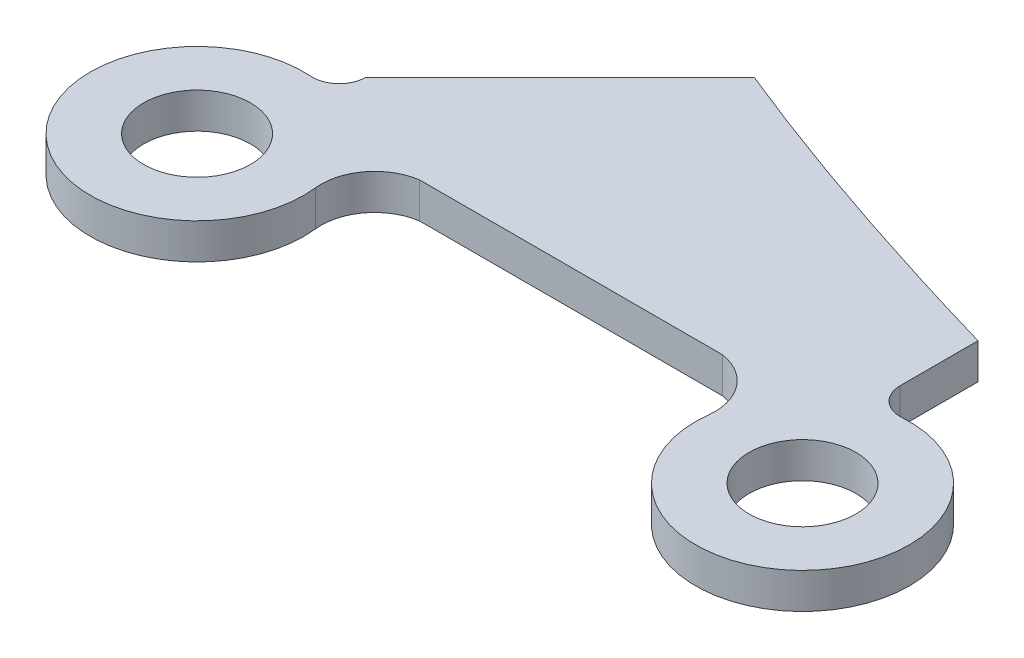
ISO-10303-21;
HEADER;
FILE_DESCRIPTION(('STEP AP214'),'2;1');
FILE_NAME('part.step','',(''),(''),'','','');
FILE_SCHEMA(('AUTOMOTIVE_DESIGN { 1 0 10303 214 1 1 1 1 }'));
ENDSEC;
DATA;
#1=APPLICATION_CONTEXT('core data for automotive mechanical design processes');
#2=APPLICATION_PROTOCOL_DEFINITION('international standard','automotive_design',2000,#1);
#3=PRODUCT_CONTEXT('',#1,'mechanical');
#4=PRODUCT('Part','Part','',(#3));
#5=PRODUCT_RELATED_PRODUCT_CATEGORY('part','',(#4));
#6=PRODUCT_DEFINITION_FORMATION('','',#4);
#7=PRODUCT_DEFINITION_CONTEXT('part definition',#1,'design');
#8=PRODUCT_DEFINITION('design','',#6,#7);
#9=PRODUCT_DEFINITION_SHAPE('','',#8);
#10=(LENGTH_UNIT() NAMED_UNIT(*) SI_UNIT(.MILLI.,.METRE.));
#11=(NAMED_UNIT(*) PLANE_ANGLE_UNIT() SI_UNIT($,.RADIAN.));
#12=(NAMED_UNIT(*) SI_UNIT($,.STERADIAN.) SOLID_ANGLE_UNIT());
#13=UNCERTAINTY_MEASURE_WITH_UNIT(LENGTH_MEASURE(1.E-05),#10,'distance_accuracy_value','');
#14=(GEOMETRIC_REPRESENTATION_CONTEXT(3) GLOBAL_UNCERTAINTY_ASSIGNED_CONTEXT((#13)) GLOBAL_UNIT_ASSIGNED_CONTEXT((#10,
#11,#12)) REPRESENTATION_CONTEXT('',''));
#15=CARTESIAN_POINT('',(0.,0.,0.));
#16=DIRECTION('',(0.,0.,1.));
#17=DIRECTION('',(1.,0.,0.));
#18=AXIS2_PLACEMENT_3D('',#15,#16,#17);
#19=CARTESIAN_POINT('',(1003.5,-336.43981096134,430.79991693377));
#20=DIRECTION('',(0.,-1.,0.));
#21=DIRECTION('',(0.,0.,-1.));
#22=AXIS2_PLACEMENT_3D('',#19,#20,#21);
#23=PLANE('',#22);
#24=CARTESIAN_POINT('',(1003.,-336.43981096134,438.283231707318));
#25=DIRECTION('',(0.,-1.,0.));
#26=DIRECTION('',(0.,0.,-1.));
#27=AXIS2_PLACEMENT_3D('',#24,#25,#26);
#28=CIRCLE('',#27,2.99999999999994);
#29=CARTESIAN_POINT('',(1003.,-336.43981096134,435.283231707318));
#30=VERTEX_POINT('',#29);
#31=EDGE_CURVE('E246',#30,#30,#28,.T.);
#32=ORIENTED_EDGE('',*,*,#31,.F.);
#33=EDGE_LOOP('',(#32));
#34=FACE_BOUND('',#33,.T.);
#35=CARTESIAN_POINT('',(1003.5,-336.43981096134,430.79991693377));
#36=DIRECTION('',(0.,-1.,0.));
#37=DIRECTION('',(0.,0.,-1.));
#38=AXIS2_PLACEMENT_3D('',#35,#36,#37);
#39=CIRCLE('',#38,1.5);
#40=CARTESIAN_POINT('',(1005.,-336.43981096134,430.79991693377));
#41=VERTEX_POINT('',#40);
#42=CARTESIAN_POINT('',(1003.4,-336.43981096134,432.29657988848));
#43=VERTEX_POINT('',#42);
#44=EDGE_CURVE('E271',#41,#43,#39,.T.);
#45=ORIENTED_EDGE('',*,*,#44,.F.);
#46=DIRECTION('',(0.707106781186916,0.,-0.707106781186179));
#47=VECTOR('',#46,1.);
#48=CARTESIAN_POINT('',(1005.,-336.43981096134,430.79991693377));
#49=LINE('',#48,#47);
#50=CARTESIAN_POINT('',(1015.90379797932,-336.43981096134,419.896118954459));
#51=VERTEX_POINT('',#50);
#52=EDGE_CURVE('E215',#41,#51,#49,.T.);
#53=ORIENTED_EDGE('',*,*,#52,.T.);
#54=CARTESIAN_POINT('',(1015.90379797933,-336.43981096134,419.896118954461));
#55=CARTESIAN_POINT('',(1021.18574672281,-336.43981096134,422.066519939314));
#56=CARTESIAN_POINT('',(1027.58904483357,-336.43981096134,424.27172398807));
#57=CARTESIAN_POINT('',(1034.99999999986,-336.43981096134,426.4272406204));
#58=(BOUNDED_CURVE() B_SPLINE_CURVE(3,(#54,#55,#56,#57),.UNSPECIFIED.,.F.,
.F.) B_SPLINE_CURVE_WITH_KNOTS((4,4),(0.141934854100476,0.193423321701997),
.UNSPECIFIED.) CURVE() GEOMETRIC_REPRESENTATION_ITEM() RATIONAL_B_SPLINE_CURVE((0.593424606066283,
0.56374935932761,0.54114361204481,0.525607364217886)) REPRESENTATION_ITEM(''));
#59=CARTESIAN_POINT('',(1034.99999999986,-336.43981096134,426.4272406204));
#60=VERTEX_POINT('',#59);
#61=EDGE_CURVE('E210',#51,#60,#58,.T.);
#62=ORIENTED_EDGE('',*,*,#61,.T.);
#63=DIRECTION('',(0.,0.,1.));
#64=VECTOR('',#63,1.);
#65=CARTESIAN_POINT('',(1035.,-336.43981096134,430.712849211409));
#66=LINE('',#65,#64);
#67=CARTESIAN_POINT('',(1035.,-336.43981096134,430.79991693377));
#68=VERTEX_POINT('',#67);
#69=EDGE_CURVE('E200',#60,#68,#66,.T.);
#70=ORIENTED_EDGE('',*,*,#69,.T.);
#71=CARTESIAN_POINT('',(1036.5,-336.43981096134,430.79991693377));
#72=DIRECTION('',(0.,-1.,0.));
#73=DIRECTION('',(0.,0.,-1.));
#74=AXIS2_PLACEMENT_3D('',#71,#72,#73);
#75=CIRCLE('',#74,1.50000000000005);
#76=CARTESIAN_POINT('',(1036.6,-336.43981096134,432.29657988848));
#77=VERTEX_POINT('',#76);
#78=EDGE_CURVE('E211',#77,#68,#75,.T.);
#79=ORIENTED_EDGE('',*,*,#78,.F.);
#80=CARTESIAN_POINT('',(1037.,-336.43981096134,438.283231707318));
#81=DIRECTION('',(0.,-1.,0.));
#82=DIRECTION('',(0.,0.,-1.));
#83=AXIS2_PLACEMENT_3D('',#80,#81,#82);
#84=CIRCLE('',#83,5.99999999999999);
#85=CARTESIAN_POINT('',(1031.03961645221,-336.43981096134,437.594880079705));
#86=VERTEX_POINT('',#85);
#87=EDGE_CURVE('E286',#77,#86,#84,.T.);
#88=ORIENTED_EDGE('',*,*,#87,.T.);
#89=CARTESIAN_POINT('',(1028.05942467832,-336.43981096134,437.250704265898));
#90=DIRECTION('',(0.,-1.,0.));
#91=DIRECTION('',(0.,0.,-1.));
#92=AXIS2_PLACEMENT_3D('',#89,#90,#91);
#93=CIRCLE('',#92,2.99999999999996);
#94=CARTESIAN_POINT('',(1028.5,-336.43981096134,434.283231707318));
#95=VERTEX_POINT('',#94);
#96=EDGE_CURVE('E283',#95,#86,#93,.T.);
#97=ORIENTED_EDGE('',*,*,#96,.F.);
#98=DIRECTION('',(-1.,0.,0.));
#99=VECTOR('',#98,1.);
#100=CARTESIAN_POINT('',(1028.5,-336.43981096134,434.283231707318));
#101=LINE('',#100,#99);
#102=CARTESIAN_POINT('',(1011.5,-336.43981096134,434.283231707318));
#103=VERTEX_POINT('',#102);
#104=EDGE_CURVE('E281',#95,#103,#101,.T.);
#105=ORIENTED_EDGE('',*,*,#104,.T.);
#106=CARTESIAN_POINT('',(1011.94057532168,-336.43981096134,437.250704265898));
#107=DIRECTION('',(0.,-1.,0.));
#108=DIRECTION('',(0.,0.,-1.));
#109=AXIS2_PLACEMENT_3D('',#106,#107,#108);
#110=CIRCLE('',#109,2.99999999999996);
#111=CARTESIAN_POINT('',(1008.96038354779,-336.43981096134,437.594880079705));
#112=VERTEX_POINT('',#111);
#113=EDGE_CURVE('E273',#112,#103,#110,.T.);
#114=ORIENTED_EDGE('',*,*,#113,.F.);
#115=CARTESIAN_POINT('',(1003.,-336.43981096134,438.283231707318));
#116=DIRECTION('',(0.,-1.,0.));
#117=DIRECTION('',(0.,0.,-1.));
#118=AXIS2_PLACEMENT_3D('',#115,#116,#117);
#119=CIRCLE('',#118,6.00000000000004);
#120=EDGE_CURVE('E178',#112,#43,#119,.T.);
#121=ORIENTED_EDGE('',*,*,#120,.T.);
#122=EDGE_LOOP('',(#45,#53,#62,#70,#79,#88,#97,#105,#114,#121));
#123=FACE_BOUND('',#122,.T.);
#124=CARTESIAN_POINT('',(1037.,-336.43981096134,438.283231707318));
#125=DIRECTION('',(0.,-1.,0.));
#126=DIRECTION('',(0.,0.,-1.));
#127=AXIS2_PLACEMENT_3D('',#124,#125,#126);
#128=CIRCLE('',#127,2.99999999999994);
#129=CARTESIAN_POINT('',(1037.,-336.43981096134,435.283231707318));
#130=VERTEX_POINT('',#129);
#131=EDGE_CURVE('E357',#130,#130,#128,.T.);
#132=ORIENTED_EDGE('',*,*,#131,.F.);
#133=EDGE_LOOP('',(#132));
#134=FACE_BOUND('',#133,.T.);
#135=ADVANCED_FACE('F116',(#34,#123,#134),#23,.T.);
#136=CARTESIAN_POINT('',(1003.5,-334.43981096134,430.79991693377));
#137=DIRECTION('',(0.,-1.,0.));
#138=DIRECTION('',(0.,0.,-1.));
#139=AXIS2_PLACEMENT_3D('',#136,#137,#138);
#140=PLANE('',#139);
#141=CARTESIAN_POINT('',(1003.5,-334.43981096134,430.79991693377));
#142=DIRECTION('',(0.,-1.,0.));
#143=DIRECTION('',(0.,0.,-1.));
#144=AXIS2_PLACEMENT_3D('',#141,#142,#143);
#145=CIRCLE('',#144,1.5);
#146=CARTESIAN_POINT('',(1005.,-334.43981096134,430.79991693377));
#147=VERTEX_POINT('',#146);
#148=CARTESIAN_POINT('',(1003.4,-334.43981096134,432.29657988848));
#149=VERTEX_POINT('',#148);
#150=EDGE_CURVE('E242',#147,#149,#145,.T.);
#151=ORIENTED_EDGE('',*,*,#150,.T.);
#152=CARTESIAN_POINT('',(1003.,-334.43981096134,438.283231707318));
#153=DIRECTION('',(0.,-1.,0.));
#154=DIRECTION('',(0.,0.,-1.));
#155=AXIS2_PLACEMENT_3D('',#152,#153,#154);
#156=CIRCLE('',#155,6.00000000000004);
#157=CARTESIAN_POINT('',(1008.96038354779,-334.43981096134,437.594880079705));
#158=VERTEX_POINT('',#157);
#159=EDGE_CURVE('E245',#158,#149,#156,.T.);
#160=ORIENTED_EDGE('',*,*,#159,.F.);
#161=CARTESIAN_POINT('',(1011.94057532168,-334.43981096134,437.250704265898));
#162=DIRECTION('',(0.,-1.,0.));
#163=DIRECTION('',(0.,0.,-1.));
#164=AXIS2_PLACEMENT_3D('',#161,#162,#163);
#165=CIRCLE('',#164,2.99999999999996);
#166=CARTESIAN_POINT('',(1011.5,-334.43981096134,434.283231707318));
#167=VERTEX_POINT('',#166);
#168=EDGE_CURVE('E248',#158,#167,#165,.T.);
#169=ORIENTED_EDGE('',*,*,#168,.T.);
#170=DIRECTION('',(-1.,0.,0.));
#171=VECTOR('',#170,1.);
#172=CARTESIAN_POINT('',(1028.5,-334.43981096134,434.283231707318));
#173=LINE('',#172,#171);
#174=CARTESIAN_POINT('',(1028.5,-334.43981096134,434.283231707318));
#175=VERTEX_POINT('',#174);
#176=EDGE_CURVE('E251',#175,#167,#173,.T.);
#177=ORIENTED_EDGE('',*,*,#176,.F.);
#178=CARTESIAN_POINT('',(1028.05942467832,-334.43981096134,437.250704265898));
#179=DIRECTION('',(0.,-1.,0.));
#180=DIRECTION('',(0.,0.,-1.));
#181=AXIS2_PLACEMENT_3D('',#178,#179,#180);
#182=CIRCLE('',#181,2.99999999999996);
#183=CARTESIAN_POINT('',(1031.03961645221,-334.43981096134,437.594880079705));
#184=VERTEX_POINT('',#183);
#185=EDGE_CURVE('E254',#175,#184,#182,.T.);
#186=ORIENTED_EDGE('',*,*,#185,.T.);
#187=CARTESIAN_POINT('',(1037.,-334.43981096134,438.283231707318));
#188=DIRECTION('',(0.,-1.,0.));
#189=DIRECTION('',(0.,0.,-1.));
#190=AXIS2_PLACEMENT_3D('',#187,#188,#189);
#191=CIRCLE('',#190,5.99999999999999);
#192=CARTESIAN_POINT('',(1036.6,-334.43981096134,432.29657988848));
#193=VERTEX_POINT('',#192);
#194=EDGE_CURVE('E257',#193,#184,#191,.T.);
#195=ORIENTED_EDGE('',*,*,#194,.F.);
#196=CARTESIAN_POINT('',(1036.5,-334.43981096134,430.79991693377));
#197=DIRECTION('',(0.,-1.,0.));
#198=DIRECTION('',(0.,0.,-1.));
#199=AXIS2_PLACEMENT_3D('',#196,#197,#198);
#200=CIRCLE('',#199,1.50000000000005);
#201=CARTESIAN_POINT('',(1035.,-334.43981096134,430.79991693377));
#202=VERTEX_POINT('',#201);
#203=EDGE_CURVE('E260',#193,#202,#200,.T.);
#204=ORIENTED_EDGE('',*,*,#203,.T.);
#205=DIRECTION('',(0.,0.,-1.));
#206=VECTOR('',#205,1.);
#207=CARTESIAN_POINT('',(1035.,-334.43981096134,430.712849211409));
#208=LINE('',#207,#206);
#209=CARTESIAN_POINT('',(1034.99999999986,-334.43981096134,426.4272406204));
#210=VERTEX_POINT('',#209);
#211=EDGE_CURVE('E263',#202,#210,#208,.T.);
#212=ORIENTED_EDGE('',*,*,#211,.T.);
#213=CARTESIAN_POINT('',(1015.90379797933,-334.43981096134,419.89611895446));
#214=CARTESIAN_POINT('',(1021.18574672281,-334.43981096134,422.066519939314));
#215=CARTESIAN_POINT('',(1027.58904483357,-334.43981096134,424.27172398807));
#216=CARTESIAN_POINT('',(1034.99999999986,-334.43981096134,426.4272406204));
#217=(BOUNDED_CURVE() B_SPLINE_CURVE(3,(#213,#214,#215,#216),.UNSPECIFIED.,.F.,
.F.) B_SPLINE_CURVE_WITH_KNOTS((4,4),(0.141934854100476,0.193423321701997),
.UNSPECIFIED.) CURVE() GEOMETRIC_REPRESENTATION_ITEM() RATIONAL_B_SPLINE_CURVE((0.593424606066283,
0.56374935932761,0.54114361204481,0.525607364217886)) REPRESENTATION_ITEM(''));
#218=CARTESIAN_POINT('',(1015.90379797932,-334.43981096134,419.896118954459));
#219=VERTEX_POINT('',#218);
#220=EDGE_CURVE('E220',#219,#210,#217,.T.);
#221=ORIENTED_EDGE('',*,*,#220,.F.);
#222=DIRECTION('',(0.707106781186916,0.,-0.707106781186179));
#223=VECTOR('',#222,1.);
#224=CARTESIAN_POINT('',(1005.,-334.43981096134,430.79991693377));
#225=LINE('',#224,#223);
#226=EDGE_CURVE('E168',#147,#219,#225,.T.);
#227=ORIENTED_EDGE('',*,*,#226,.F.);
#228=EDGE_LOOP('',(#151,#160,#169,#177,#186,#195,#204,#212,#221,#227));
#229=FACE_BOUND('',#228,.T.);
#230=CARTESIAN_POINT('',(1003.,-334.43981096134,438.283231707318));
#231=DIRECTION('',(0.,-1.,0.));
#232=DIRECTION('',(0.,0.,-1.));
#233=AXIS2_PLACEMENT_3D('',#230,#231,#232);
#234=CIRCLE('',#233,2.99999999999994);
#235=CARTESIAN_POINT('',(1003.,-334.43981096134,435.283231707318));
#236=VERTEX_POINT('',#235);
#237=EDGE_CURVE('E276',#236,#236,#234,.T.);
#238=ORIENTED_EDGE('',*,*,#237,.T.);
#239=EDGE_LOOP('',(#238));
#240=FACE_BOUND('',#239,.T.);
#241=CARTESIAN_POINT('',(1037.,-334.43981096134,438.283231707318));
#242=DIRECTION('',(0.,-1.,0.));
#243=DIRECTION('',(0.,0.,-1.));
#244=AXIS2_PLACEMENT_3D('',#241,#242,#243);
#245=CIRCLE('',#244,2.99999999999994);
#246=CARTESIAN_POINT('',(1037.,-334.43981096134,435.283231707318));
#247=VERTEX_POINT('',#246);
#248=EDGE_CURVE('E359',#247,#247,#245,.T.);
#249=ORIENTED_EDGE('',*,*,#248,.T.);
#250=EDGE_LOOP('',(#249));
#251=FACE_BOUND('',#250,.T.);
#252=ADVANCED_FACE('F310',(#229,#240,#251),#140,.F.);
#253=CARTESIAN_POINT('',(1003.5,-336.43981096134,430.79991693377));
#254=DIRECTION('',(0.,1.,0.));
#255=DIRECTION('',(0.,0.,1.));
#256=AXIS2_PLACEMENT_3D('',#253,#254,#255);
#257=CYLINDRICAL_SURFACE('',#256,1.5);
#258=ORIENTED_EDGE('',*,*,#150,.F.);
#259=DIRECTION('',(0.,1.,0.));
#260=VECTOR('',#259,1.);
#261=CARTESIAN_POINT('',(1005.,-336.43981096134,430.79991693377));
#262=LINE('',#261,#260);
#263=EDGE_CURVE('E12',#41,#147,#262,.T.);
#264=ORIENTED_EDGE('',*,*,#263,.F.);
#265=ORIENTED_EDGE('',*,*,#44,.T.);
#266=DIRECTION('',(0.,1.,0.));
#267=VECTOR('',#266,1.);
#268=CARTESIAN_POINT('',(1003.4,-336.43981096134,432.29657988848));
#269=LINE('',#268,#267);
#270=EDGE_CURVE('E120',#43,#149,#269,.T.);
#271=ORIENTED_EDGE('',*,*,#270,.T.);
#272=EDGE_LOOP('',(#258,#264,#265,#271));
#273=FACE_BOUND('',#272,.T.);
#274=ADVANCED_FACE('F118',(#273),#257,.F.);
#275=CARTESIAN_POINT('',(1005.,-336.43981096134,430.79991693377));
#276=DIRECTION('',(0.707106781186179,0.,0.707106781186916));
#277=DIRECTION('',(0.707106781186916,0.,-0.707106781186179));
#278=AXIS2_PLACEMENT_3D('',#275,#276,#277);
#279=PLANE('',#278);
#280=ORIENTED_EDGE('',*,*,#226,.T.);
#281=DIRECTION('',(0.,1.,0.));
#282=VECTOR('',#281,1.);
#283=CARTESIAN_POINT('',(1015.90379797932,-336.43981096134,419.896118954459));
#284=LINE('',#283,#282);
#285=EDGE_CURVE('E126',#51,#219,#284,.T.);
#286=ORIENTED_EDGE('',*,*,#285,.F.);
#287=ORIENTED_EDGE('',*,*,#52,.F.);
#288=ORIENTED_EDGE('',*,*,#263,.T.);
#289=EDGE_LOOP('',(#280,#286,#287,#288));
#290=FACE_BOUND('',#289,.T.);
#291=ADVANCED_FACE('F313',(#290),#279,.F.);
#292=DIRECTION('',(0.,1.,0.));
#293=VECTOR('',#292,1.);
#294=SURFACE_OF_LINEAR_EXTRUSION('',#58,#293);
#295=ORIENTED_EDGE('',*,*,#220,.T.);
#296=DIRECTION('',(0.,1.,0.));
#297=VECTOR('',#296,1.);
#298=CARTESIAN_POINT('',(1034.99999999986,-336.43981096134,426.4272406204));
#299=LINE('',#298,#297);
#300=EDGE_CURVE('E204',#60,#210,#299,.T.);
#301=ORIENTED_EDGE('',*,*,#300,.F.);
#302=ORIENTED_EDGE('',*,*,#61,.F.);
#303=ORIENTED_EDGE('',*,*,#285,.T.);
#304=EDGE_LOOP('',(#295,#301,#302,#303));
#305=FACE_BOUND('',#304,.T.);
#306=ADVANCED_FACE('F218',(#305),#294,.F.);
#307=CARTESIAN_POINT('',(1035.,-336.43981096134,430.712849211409));
#308=DIRECTION('',(1.,0.,0.));
#309=DIRECTION('',(0.,0.,-1.));
#310=AXIS2_PLACEMENT_3D('',#307,#308,#309);
#311=PLANE('',#310);
#312=ORIENTED_EDGE('',*,*,#211,.F.);
#313=DIRECTION('',(0.,1.,0.));
#314=VECTOR('',#313,1.);
#315=CARTESIAN_POINT('',(1035.,-336.43981096134,430.79991693377));
#316=LINE('',#315,#314);
#317=EDGE_CURVE('E207',#68,#202,#316,.T.);
#318=ORIENTED_EDGE('',*,*,#317,.F.);
#319=ORIENTED_EDGE('',*,*,#69,.F.);
#320=ORIENTED_EDGE('',*,*,#300,.T.);
#321=EDGE_LOOP('',(#312,#318,#319,#320));
#322=FACE_BOUND('',#321,.T.);
#323=ADVANCED_FACE('F202',(#322),#311,.T.);
#324=CARTESIAN_POINT('',(1036.5,-336.43981096134,430.79991693377));
#325=DIRECTION('',(0.,1.,0.));
#326=DIRECTION('',(0.,0.,1.));
#327=AXIS2_PLACEMENT_3D('',#324,#325,#326);
#328=CYLINDRICAL_SURFACE('',#327,1.50000000000005);
#329=ORIENTED_EDGE('',*,*,#203,.F.);
#330=DIRECTION('',(0.,1.,0.));
#331=VECTOR('',#330,1.);
#332=CARTESIAN_POINT('',(1036.6,-336.43981096134,432.29657988848));
#333=LINE('',#332,#331);
#334=EDGE_CURVE('E224',#77,#193,#333,.T.);
#335=ORIENTED_EDGE('',*,*,#334,.F.);
#336=ORIENTED_EDGE('',*,*,#78,.T.);
#337=ORIENTED_EDGE('',*,*,#317,.T.);
#338=EDGE_LOOP('',(#329,#335,#336,#337));
#339=FACE_BOUND('',#338,.T.);
#340=ADVANCED_FACE('F290',(#339),#328,.F.);
#341=CARTESIAN_POINT('',(1037.,-336.43981096134,438.283231707318));
#342=DIRECTION('',(0.,1.,0.));
#343=DIRECTION('',(0.,0.,1.));
#344=AXIS2_PLACEMENT_3D('',#341,#342,#343);
#345=CYLINDRICAL_SURFACE('',#344,5.99999999999999);
#346=ORIENTED_EDGE('',*,*,#194,.T.);
#347=DIRECTION('',(0.,1.,0.));
#348=VECTOR('',#347,1.);
#349=CARTESIAN_POINT('',(1031.03961645221,-336.43981096134,437.594880079705));
#350=LINE('',#349,#348);
#351=EDGE_CURVE('E228',#86,#184,#350,.T.);
#352=ORIENTED_EDGE('',*,*,#351,.F.);
#353=ORIENTED_EDGE('',*,*,#87,.F.);
#354=ORIENTED_EDGE('',*,*,#334,.T.);
#355=EDGE_LOOP('',(#346,#352,#353,#354));
#356=FACE_BOUND('',#355,.T.);
#357=ADVANCED_FACE('F295',(#356),#345,.T.);
#358=CARTESIAN_POINT('',(1028.05942467832,-336.43981096134,437.250704265898));
#359=DIRECTION('',(0.,1.,0.));
#360=DIRECTION('',(0.,0.,1.));
#361=AXIS2_PLACEMENT_3D('',#358,#359,#360);
#362=CYLINDRICAL_SURFACE('',#361,2.99999999999996);
#363=ORIENTED_EDGE('',*,*,#185,.F.);
#364=DIRECTION('',(0.,1.,0.));
#365=VECTOR('',#364,1.);
#366=CARTESIAN_POINT('',(1028.5,-336.43981096134,434.283231707318));
#367=LINE('',#366,#365);
#368=EDGE_CURVE('E230',#95,#175,#367,.T.);
#369=ORIENTED_EDGE('',*,*,#368,.F.);
#370=ORIENTED_EDGE('',*,*,#96,.T.);
#371=ORIENTED_EDGE('',*,*,#351,.T.);
#372=EDGE_LOOP('',(#363,#369,#370,#371));
#373=FACE_BOUND('',#372,.T.);
#374=ADVANCED_FACE('F299',(#373),#362,.F.);
#375=CARTESIAN_POINT('',(1028.5,-336.43981096134,434.283231707318));
#376=DIRECTION('',(0.,0.,-1.));
#377=DIRECTION('',(0.,1.,0.));
#378=AXIS2_PLACEMENT_3D('',#375,#376,#377);
#379=PLANE('',#378);
#380=ORIENTED_EDGE('',*,*,#176,.T.);
#381=DIRECTION('',(0.,1.,0.));
#382=VECTOR('',#381,1.);
#383=CARTESIAN_POINT('',(1011.5,-336.43981096134,434.283231707318));
#384=LINE('',#383,#382);
#385=EDGE_CURVE('E232',#103,#167,#384,.T.);
#386=ORIENTED_EDGE('',*,*,#385,.F.);
#387=ORIENTED_EDGE('',*,*,#104,.F.);
#388=ORIENTED_EDGE('',*,*,#368,.T.);
#389=EDGE_LOOP('',(#380,#386,#387,#388));
#390=FACE_BOUND('',#389,.T.);
#391=ADVANCED_FACE('F304',(#390),#379,.F.);
#392=CARTESIAN_POINT('',(1011.94057532168,-336.43981096134,437.250704265898));
#393=DIRECTION('',(0.,1.,0.));
#394=DIRECTION('',(0.,0.,1.));
#395=AXIS2_PLACEMENT_3D('',#392,#393,#394);
#396=CYLINDRICAL_SURFACE('',#395,2.99999999999996);
#397=ORIENTED_EDGE('',*,*,#168,.F.);
#398=DIRECTION('',(0.,1.,0.));
#399=VECTOR('',#398,1.);
#400=CARTESIAN_POINT('',(1008.96038354779,-336.43981096134,437.594880079705));
#401=LINE('',#400,#399);
#402=EDGE_CURVE('E233',#112,#158,#401,.T.);
#403=ORIENTED_EDGE('',*,*,#402,.F.);
#404=ORIENTED_EDGE('',*,*,#113,.T.);
#405=ORIENTED_EDGE('',*,*,#385,.T.);
#406=EDGE_LOOP('',(#397,#403,#404,#405));
#407=FACE_BOUND('',#406,.T.);
#408=ADVANCED_FACE('F307',(#407),#396,.F.);
#409=CARTESIAN_POINT('',(1003.,-336.43981096134,438.283231707318));
#410=DIRECTION('',(0.,1.,0.));
#411=DIRECTION('',(0.,0.,1.));
#412=AXIS2_PLACEMENT_3D('',#409,#410,#411);
#413=CYLINDRICAL_SURFACE('',#412,6.00000000000004);
#414=ORIENTED_EDGE('',*,*,#159,.T.);
#415=ORIENTED_EDGE('',*,*,#270,.F.);
#416=ORIENTED_EDGE('',*,*,#120,.F.);
#417=ORIENTED_EDGE('',*,*,#402,.T.);
#418=EDGE_LOOP('',(#414,#415,#416,#417));
#419=FACE_BOUND('',#418,.T.);
#420=ADVANCED_FACE('F308',(#419),#413,.T.);
#421=CARTESIAN_POINT('',(1003.,-336.43981096134,438.283231707318));
#422=DIRECTION('',(0.,1.,0.));
#423=DIRECTION('',(0.,0.,1.));
#424=AXIS2_PLACEMENT_3D('',#421,#422,#423);
#425=CYLINDRICAL_SURFACE('',#424,2.99999999999994);
#426=ORIENTED_EDGE('',*,*,#31,.T.);
#427=EDGE_LOOP('',(#426));
#428=FACE_BOUND('',#427,.T.);
#429=ORIENTED_EDGE('',*,*,#237,.F.);
#430=EDGE_LOOP('',(#429));
#431=FACE_BOUND('',#430,.T.);
#432=ADVANCED_FACE('F327',(#428,#431),#425,.F.);
#433=CARTESIAN_POINT('',(1037.,-336.43981096134,438.283231707318));
#434=DIRECTION('',(0.,1.,0.));
#435=DIRECTION('',(0.,0.,1.));
#436=AXIS2_PLACEMENT_3D('',#433,#434,#435);
#437=CYLINDRICAL_SURFACE('',#436,2.99999999999994);
#438=ORIENTED_EDGE('',*,*,#131,.T.);
#439=EDGE_LOOP('',(#438));
#440=FACE_BOUND('',#439,.T.);
#441=ORIENTED_EDGE('',*,*,#248,.F.);
#442=EDGE_LOOP('',(#441));
#443=FACE_BOUND('',#442,.T.);
#444=ADVANCED_FACE('F347',(#440,#443),#437,.F.);
#445=CLOSED_SHELL('',(#135,#252,#274,#291,#306,#323,#340,#357,#374,#391,#408,#420,#432,#444));
#446=MANIFOLD_SOLID_BREP('B2',#445);
#447=ADVANCED_BREP_SHAPE_REPRESENTATION('',(#18,#446),#14);
#448=SHAPE_DEFINITION_REPRESENTATION(#9,#447);
ENDSEC;
END-ISO-10303-21;
